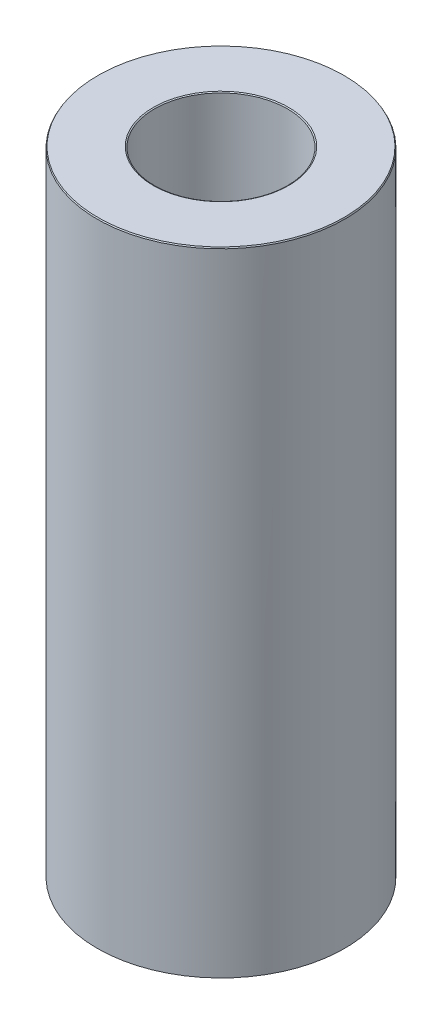
ISO-10303-21;
HEADER;
FILE_DESCRIPTION(('STEP AP214'),'2;1');
FILE_NAME('part.step','',(''),(''),'','','');
FILE_SCHEMA(('AUTOMOTIVE_DESIGN { 1 0 10303 214 1 1 1 1 }'));
ENDSEC;
DATA;
#1=APPLICATION_CONTEXT('core data for automotive mechanical design processes');
#2=APPLICATION_PROTOCOL_DEFINITION('international standard','automotive_design',2000,#1);
#3=PRODUCT_CONTEXT('',#1,'mechanical');
#4=PRODUCT('Part','Part','',(#3));
#5=PRODUCT_RELATED_PRODUCT_CATEGORY('part','',(#4));
#6=PRODUCT_DEFINITION_FORMATION('','',#4);
#7=PRODUCT_DEFINITION_CONTEXT('part definition',#1,'design');
#8=PRODUCT_DEFINITION('design','',#6,#7);
#9=PRODUCT_DEFINITION_SHAPE('','',#8);
#10=(LENGTH_UNIT() NAMED_UNIT(*) SI_UNIT(.MILLI.,.METRE.));
#11=(NAMED_UNIT(*) PLANE_ANGLE_UNIT() SI_UNIT($,.RADIAN.));
#12=(NAMED_UNIT(*) SI_UNIT($,.STERADIAN.) SOLID_ANGLE_UNIT());
#13=UNCERTAINTY_MEASURE_WITH_UNIT(LENGTH_MEASURE(1.E-05),#10,'distance_accuracy_value','');
#14=(GEOMETRIC_REPRESENTATION_CONTEXT(3) GLOBAL_UNCERTAINTY_ASSIGNED_CONTEXT((#13)) GLOBAL_UNIT_ASSIGNED_CONTEXT((#10,
#11,#12)) REPRESENTATION_CONTEXT('',''));
#15=CARTESIAN_POINT('',(0.,0.,0.));
#16=DIRECTION('',(0.,0.,1.));
#17=DIRECTION('',(1.,0.,0.));
#18=AXIS2_PLACEMENT_3D('',#15,#16,#17);
#19=CARTESIAN_POINT('',(0.,255.949453428713,0.));
#20=DIRECTION('',(0.,-1.,0.));
#21=DIRECTION('',(0.,0.,-1.));
#22=AXIS2_PLACEMENT_3D('',#19,#20,#21);
#23=CYLINDRICAL_SURFACE('',#22,50.);
#24=CARTESIAN_POINT('',(0.,0.272738288662366,0.));
#25=DIRECTION('',(0.,1.,0.));
#26=DIRECTION('',(0.,0.,1.));
#27=AXIS2_PLACEMENT_3D('',#24,#25,#26);
#28=CIRCLE('',#27,50.);
#29=CARTESIAN_POINT('',(0.,0.272738288662366,50.));
#30=VERTEX_POINT('',#29);
#31=EDGE_CURVE('E10',#30,#30,#28,.T.);
#32=ORIENTED_EDGE('',*,*,#31,.T.);
#33=EDGE_LOOP('',(#32));
#34=FACE_BOUND('',#33,.T.);
#35=CARTESIAN_POINT('',(0.,255.47705685558,0.));
#36=DIRECTION('',(0.,1.,0.));
#37=DIRECTION('',(0.,0.,1.));
#38=AXIS2_PLACEMENT_3D('',#35,#36,#37);
#39=CIRCLE('',#38,50.);
#40=CARTESIAN_POINT('',(0.,255.47705685558,-50.));
#41=VERTEX_POINT('',#40);
#42=EDGE_CURVE('E50',#41,#41,#39,.F.);
#43=ORIENTED_EDGE('',*,*,#42,.T.);
#44=EDGE_LOOP('',(#43));
#45=FACE_BOUND('',#44,.T.);
#46=ADVANCED_FACE('F39',(#34,#45),#23,.T.);
#47=CARTESIAN_POINT('',(0.,255.949453428713,0.));
#48=DIRECTION('',(0.,1.,0.));
#49=DIRECTION('',(0.,0.,1.));
#50=AXIS2_PLACEMENT_3D('',#47,#48,#49);
#51=PLANE('',#50);
#52=CARTESIAN_POINT('',(0.,255.949453428713,0.));
#53=DIRECTION('',(0.,1.,0.));
#54=DIRECTION('',(0.,0.,1.));
#55=AXIS2_PLACEMENT_3D('',#52,#53,#54);
#56=CIRCLE('',#55,27.3661072955156);
#57=CARTESIAN_POINT('',(0.,255.949453428713,27.3661072955156));
#58=VERTEX_POINT('',#57);
#59=EDGE_CURVE('E58',#58,#58,#56,.F.);
#60=ORIENTED_EDGE('',*,*,#59,.T.);
#61=EDGE_LOOP('',(#60));
#62=FACE_BOUND('',#61,.T.);
#63=CARTESIAN_POINT('',(0.,255.949453428713,0.));
#64=DIRECTION('',(0.,1.,0.));
#65=DIRECTION('',(0.,0.,1.));
#66=AXIS2_PLACEMENT_3D('',#63,#64,#65);
#67=CIRCLE('',#66,49.7272617113375);
#68=CARTESIAN_POINT('',(0.,255.949453428713,-49.7272617113376));
#69=VERTEX_POINT('',#68);
#70=EDGE_CURVE('E61',#69,#69,#67,.T.);
#71=ORIENTED_EDGE('',*,*,#70,.T.);
#72=EDGE_LOOP('',(#71));
#73=FACE_BOUND('',#72,.T.);
#74=ADVANCED_FACE('F88',(#62,#73),#51,.T.);
#75=CARTESIAN_POINT('',(0.,0.,0.));
#76=DIRECTION('',(0.,1.,0.));
#77=DIRECTION('',(0.,0.,1.));
#78=AXIS2_PLACEMENT_3D('',#75,#76,#77);
#79=PLANE('',#78);
#80=CARTESIAN_POINT('',(0.,0.,0.));
#81=DIRECTION('',(0.,1.,0.));
#82=DIRECTION('',(0.,0.,1.));
#83=AXIS2_PLACEMENT_3D('',#80,#81,#82);
#84=CIRCLE('',#83,27.1664490110454);
#85=CARTESIAN_POINT('',(0.,0.,-27.1664490110454));
#86=VERTEX_POINT('',#85);
#87=EDGE_CURVE('E51',#86,#86,#84,.T.);
#88=ORIENTED_EDGE('',*,*,#87,.T.);
#89=EDGE_LOOP('',(#88));
#90=FACE_BOUND('',#89,.T.);
#91=CARTESIAN_POINT('',(0.,0.,0.));
#92=DIRECTION('',(0.,1.,0.));
#93=DIRECTION('',(0.,0.,1.));
#94=AXIS2_PLACEMENT_3D('',#91,#92,#93);
#95=CIRCLE('',#94,49.5276034268674);
#96=CARTESIAN_POINT('',(0.,0.,49.5276034268674));
#97=VERTEX_POINT('',#96);
#98=EDGE_CURVE('E54',#97,#97,#95,.F.);
#99=ORIENTED_EDGE('',*,*,#98,.T.);
#100=EDGE_LOOP('',(#99));
#101=FACE_BOUND('',#100,.T.);
#102=ADVANCED_FACE('F83',(#90,#101),#79,.F.);
#103=CARTESIAN_POINT('',(0.,255.949453428713,0.));
#104=DIRECTION('',(0.,-1.,0.));
#105=DIRECTION('',(0.,0.,-1.));
#106=AXIS2_PLACEMENT_3D('',#103,#104,#105);
#107=CYLINDRICAL_SURFACE('',#106,26.893710722383);
#108=CARTESIAN_POINT('',(0.,255.67671514005,0.));
#109=DIRECTION('',(0.,1.,0.));
#110=DIRECTION('',(0.,0.,1.));
#111=AXIS2_PLACEMENT_3D('',#108,#109,#110);
#112=CIRCLE('',#111,26.893710722383);
#113=CARTESIAN_POINT('',(0.,255.67671514005,26.893710722383));
#114=VERTEX_POINT('',#113);
#115=EDGE_CURVE('E67',#114,#114,#112,.T.);
#116=ORIENTED_EDGE('',*,*,#115,.T.);
#117=EDGE_LOOP('',(#116));
#118=FACE_BOUND('',#117,.T.);
#119=CARTESIAN_POINT('',(0.,0.472396573132694,0.));
#120=DIRECTION('',(0.,1.,0.));
#121=DIRECTION('',(0.,0.,1.));
#122=AXIS2_PLACEMENT_3D('',#119,#120,#121);
#123=CIRCLE('',#122,26.893710722383);
#124=CARTESIAN_POINT('',(0.,0.472396573132694,-26.893710722383));
#125=VERTEX_POINT('',#124);
#126=EDGE_CURVE('E69',#125,#125,#123,.F.);
#127=ORIENTED_EDGE('',*,*,#126,.T.);
#128=EDGE_LOOP('',(#127));
#129=FACE_BOUND('',#128,.T.);
#130=ADVANCED_FACE('F71',(#118,#129),#107,.F.);
#131=CARTESIAN_POINT('',(0.,255.67671514005,0.));
#132=DIRECTION('',(0.,1.,0.));
#133=DIRECTION('',(0.,0.,1.));
#134=AXIS2_PLACEMENT_3D('',#131,#132,#133);
#135=CONICAL_SURFACE('',#134,26.893710722383,1.04719755119662);
#136=ORIENTED_EDGE('',*,*,#59,.F.);
#137=EDGE_LOOP('',(#136));
#138=FACE_BOUND('',#137,.T.);
#139=ORIENTED_EDGE('',*,*,#115,.F.);
#140=EDGE_LOOP('',(#139));
#141=FACE_BOUND('',#140,.T.);
#142=ADVANCED_FACE('F77',(#138,#141),#135,.F.);
#143=CARTESIAN_POINT('',(0.,0.,0.));
#144=DIRECTION('',(0.,-1.,0.));
#145=DIRECTION('',(0.,0.,-1.));
#146=AXIS2_PLACEMENT_3D('',#143,#144,#145);
#147=CONICAL_SURFACE('',#146,27.1664490110454,0.523598775598251);
#148=CARTESIAN_POINT('',(0.,0.472396573132694,-26.893710722383));
#149=CARTESIAN_POINT('',(0.,0.467475775495895,-26.8965517462232));
#150=CARTESIAN_POINT('',(0.,0.462554977859096,-26.8993927700635));
#151=CARTESIAN_POINT('',(0.,0.452713382585498,-26.9050748177439));
#152=CARTESIAN_POINT('',(0.,0.447792584948699,-26.9079158415842));
#153=CARTESIAN_POINT('',(0.,0.437950989675102,-26.9135978892646));
#154=CARTESIAN_POINT('',(0.,0.433030192038303,-26.9164389131049));
#155=CARTESIAN_POINT('',(0.,0.423188596764705,-26.9221209607853));
#156=CARTESIAN_POINT('',(0.,0.418267799127906,-26.9249619846256));
#157=CARTESIAN_POINT('',(0.,0.408426203854308,-26.930644032306));
#158=CARTESIAN_POINT('',(0.,0.403505406217509,-26.9334850561463));
#159=CARTESIAN_POINT('',(0.,0.393663810943912,-26.9391671038267));
#160=CARTESIAN_POINT('',(0.,0.388743013307113,-26.942008127667));
#161=CARTESIAN_POINT('',(0.,0.378901418033515,-26.9476901753474));
#162=CARTESIAN_POINT('',(0.,0.373980620396716,-26.9505311991877));
#163=CARTESIAN_POINT('',(0.,0.364139025123118,-26.9562132468681));
#164=CARTESIAN_POINT('',(0.,0.359218227486319,-26.9590542707084));
#165=CARTESIAN_POINT('',(0.,0.349376632212722,-26.9647363183888));
#166=CARTESIAN_POINT('',(0.,0.344455834575923,-26.9675773422291));
#167=CARTESIAN_POINT('',(0.,0.334614239302325,-26.9732593899095));
#168=CARTESIAN_POINT('',(0.,0.329693441665526,-26.9761004137498));
#169=CARTESIAN_POINT('',(0.,0.319851846391928,-26.9817824614302));
#170=CARTESIAN_POINT('',(0.,0.314931048755129,-26.9846234852705));
#171=CARTESIAN_POINT('',(0.,0.305089453481531,-26.9903055329509));
#172=CARTESIAN_POINT('',(0.,0.300168655844733,-26.9931465567912));
#173=CARTESIAN_POINT('',(0.,0.290327060571135,-26.9988286044716));
#174=CARTESIAN_POINT('',(0.,0.285406262934336,-27.0016696283119));
#175=CARTESIAN_POINT('',(0.,0.275564667660738,-27.0073516759923));
#176=CARTESIAN_POINT('',(0.,0.270643870023939,-27.0101926998326));
#177=CARTESIAN_POINT('',(0.,0.260802274750342,-27.015874747513));
#178=CARTESIAN_POINT('',(0.,0.255881477113543,-27.0187157713533));
#179=CARTESIAN_POINT('',(0.,0.246039881839945,-27.0243978190337));
#180=CARTESIAN_POINT('',(0.,0.241119084203146,-27.027238842874));
#181=CARTESIAN_POINT('',(0.,0.231277488929548,-27.0329208905544));
#182=CARTESIAN_POINT('',(0.,0.226356691292749,-27.0357619143947));
#183=CARTESIAN_POINT('',(0.,0.216515096019151,-27.0414439620751));
#184=CARTESIAN_POINT('',(0.,0.211594298382352,-27.0442849859154));
#185=CARTESIAN_POINT('',(0.,0.201752703108755,-27.0499670335958));
#186=CARTESIAN_POINT('',(0.,0.196831905471956,-27.0528080574361));
#187=CARTESIAN_POINT('',(0.,0.186990310198358,-27.0584901051165));
#188=CARTESIAN_POINT('',(0.,0.182069512561559,-27.0613311289568));
#189=CARTESIAN_POINT('',(0.,0.172227917287961,-27.0670131766372));
#190=CARTESIAN_POINT('',(0.,0.167307119651162,-27.0698542004775));
#191=CARTESIAN_POINT('',(0.,0.157465524377565,-27.0755362481579));
#192=CARTESIAN_POINT('',(0.,0.152544726740766,-27.0783772719982));
#193=CARTESIAN_POINT('',(0.,0.142703131467168,-27.0840593196786));
#194=CARTESIAN_POINT('',(0.,0.137782333830369,-27.0869003435189));
#195=CARTESIAN_POINT('',(0.,0.127940738556771,-27.0925823911993));
#196=CARTESIAN_POINT('',(0.,0.123019940919972,-27.0954234150396));
#197=CARTESIAN_POINT('',(0.,0.113178345646374,-27.10110546272));
#198=CARTESIAN_POINT('',(0.,0.108257548009576,-27.1039464865603));
#199=CARTESIAN_POINT('',(0.,0.0984159527359782,-27.1096285342407));
#200=CARTESIAN_POINT('',(0.,0.0934951550991791,-27.112469558081));
#201=CARTESIAN_POINT('',(0.,0.0836535598255811,-27.1181516057614));
#202=CARTESIAN_POINT('',(0.,0.0787327621887823,-27.1209926296017));
#203=CARTESIAN_POINT('',(0.,0.0688911669151846,-27.1266746772821));
#204=CARTESIAN_POINT('',(0.,0.0639703692783857,-27.1295157011224));
#205=CARTESIAN_POINT('',(0.,0.0541287740047878,-27.1351977488028));
#206=CARTESIAN_POINT('',(0.,0.0492079763679886,-27.1380387726431));
#207=CARTESIAN_POINT('',(0.,0.039366381094391,-27.1437208203235));
#208=CARTESIAN_POINT('',(0.,0.0344455834575924,-27.1465618441638));
#209=CARTESIAN_POINT('',(0.,0.0246039881839948,-27.1522438918442));
#210=CARTESIAN_POINT('',(0.,0.0196831905471958,-27.1550849156845));
#211=CARTESIAN_POINT('',(0.,0.00984159527359762,-27.1607669633649));
#212=CARTESIAN_POINT('',(0.,0.00492079763679855,-27.1636079872052));
#213=CARTESIAN_POINT('',(0.,0.,-27.1664490110454));
#214=B_SPLINE_CURVE_WITH_KNOTS('',3,(#148,#149,#150,#151,#152,#153,#154,#155,#156,#157,#158,
#159,#160,#161,#162,#163,#164,#165,#166,#167,#168,#169,#170,#171,#172,#173,#174,#175,#176,#177,
#178,#179,#180,#181,#182,#183,#184,#185,#186,#187,#188,#189,#190,#191,#192,#193,#194,#195,#196,
#197,#198,#199,#200,#201,#202,#203,#204,#205,#206,#207,#208,#209,#210,#211,#212,#213),
.UNSPECIFIED.,.F.,.F.,(4,2,2,2,2,2,2,2,2,2,2,2,2,2,2,2,2,2,2,2,2,2,2,2,2,2,2,2,2,2,2,2,4),(0.,
0.0170461430414003,0.0340922860828006,0.0511384291242026,0.0681845721656029,0.0852307152070032,
0.102276858248404,0.119323001289804,0.136369144331206,0.153415287372606,0.170461430414006,
0.187507573455407,0.204553716496807,0.221599859538207,0.238646002579609,0.25569214562101,
0.27273828866241,0.28978443170381,0.306830574745211,0.323876717786613,0.340922860828013,
0.357969003869413,0.375015146910814,0.392061289952214,0.409107432993614,0.426153576035016,
0.443199719076416,0.460245862117817,0.477292005159217,0.494338148200617,0.511384291242019,
0.52843043428342,0.54547657732482),.UNSPECIFIED.);
#215=EDGE_CURVE('BSEAM73',#125,#86,#214,.T.);
#216=ORIENTED_EDGE('',*,*,#126,.F.);
#217=ORIENTED_EDGE('',*,*,#87,.F.);
#218=ORIENTED_EDGE('',*,*,#215,.T.);
#219=ORIENTED_EDGE('',*,*,#215,.F.);
#220=EDGE_LOOP('',(#216,#218,#217,#219));
#221=FACE_BOUND('',#220,.T.);
#222=ADVANCED_FACE('F73',(#221),#147,.F.);
#223=CARTESIAN_POINT('',(0.,0.272738288662366,0.));
#224=DIRECTION('',(0.,1.,0.));
#225=DIRECTION('',(0.,0.,1.));
#226=AXIS2_PLACEMENT_3D('',#223,#224,#225);
#227=CONICAL_SURFACE('',#226,50.,1.04719755119662);
#228=ORIENTED_EDGE('',*,*,#98,.F.);
#229=EDGE_LOOP('',(#228));
#230=FACE_BOUND('',#229,.T.);
#231=ORIENTED_EDGE('',*,*,#31,.F.);
#232=EDGE_LOOP('',(#231));
#233=FACE_BOUND('',#232,.T.);
#234=ADVANCED_FACE('F76',(#230,#233),#227,.T.);
#235=CARTESIAN_POINT('',(0.,255.949453428713,0.));
#236=DIRECTION('',(0.,-1.,0.));
#237=DIRECTION('',(0.,0.,-1.));
#238=AXIS2_PLACEMENT_3D('',#235,#236,#237);
#239=CONICAL_SURFACE('',#238,49.7272617113375,0.523598775598321);
#240=CARTESIAN_POINT('',(0.,255.47705685558,-50.));
#241=CARTESIAN_POINT('',(0.,255.481977653217,-49.9971589761598));
#242=CARTESIAN_POINT('',(0.,255.486898450853,-49.9943179523196));
#243=CARTESIAN_POINT('',(0.,255.496740046127,-49.9886359046391));
#244=CARTESIAN_POINT('',(0.,255.501660843764,-49.9857948807988));
#245=CARTESIAN_POINT('',(0.,255.511502439037,-49.9801128331184));
#246=CARTESIAN_POINT('',(0.,255.516423236674,-49.9772718092782));
#247=CARTESIAN_POINT('',(0.,255.526264831948,-49.9715897615977));
#248=CARTESIAN_POINT('',(0.,255.531185629585,-49.9687487377574));
#249=CARTESIAN_POINT('',(0.,255.541027224858,-49.963066690077));
#250=CARTESIAN_POINT('',(0.,255.545948022495,-49.9602256662368));
#251=CARTESIAN_POINT('',(0.,255.555789617769,-49.9545436185563));
#252=CARTESIAN_POINT('',(0.,255.560710415405,-49.951702594716));
#253=CARTESIAN_POINT('',(0.,255.570552010679,-49.9460205470356));
#254=CARTESIAN_POINT('',(0.,255.575472808316,-49.9431795231953));
#255=CARTESIAN_POINT('',(0.,255.58531440359,-49.9374974755149));
#256=CARTESIAN_POINT('',(0.,255.590235201226,-49.9346564516746));
#257=CARTESIAN_POINT('',(0.,255.6000767965,-49.9289744039942));
#258=CARTESIAN_POINT('',(0.,255.604997594137,-49.9261333801539));
#259=CARTESIAN_POINT('',(0.,255.61483918941,-49.9204513324735));
#260=CARTESIAN_POINT('',(0.,255.619759987047,-49.9176103086332));
#261=CARTESIAN_POINT('',(0.,255.629601582321,-49.9119282609528));
#262=CARTESIAN_POINT('',(0.,255.634522379957,-49.9090872371125));
#263=CARTESIAN_POINT('',(0.,255.644363975231,-49.9034051894321));
#264=CARTESIAN_POINT('',(0.,255.649284772868,-49.9005641655918));
#265=CARTESIAN_POINT('',(0.,255.659126368141,-49.8948821179114));
#266=CARTESIAN_POINT('',(0.,255.664047165778,-49.8920410940711));
#267=CARTESIAN_POINT('',(0.,255.673888761052,-49.8863590463907));
#268=CARTESIAN_POINT('',(0.,255.678809558689,-49.8835180225504));
#269=CARTESIAN_POINT('',(0.,255.688651153962,-49.87783597487));
#270=CARTESIAN_POINT('',(0.,255.693571951599,-49.8749949510297));
#271=CARTESIAN_POINT('',(0.,255.703413546873,-49.8693129033493));
#272=CARTESIAN_POINT('',(0.,255.708334344509,-49.866471879509));
#273=CARTESIAN_POINT('',(0.,255.718175939783,-49.8607898318285));
#274=CARTESIAN_POINT('',(0.,255.72309673742,-49.8579488079883));
#275=CARTESIAN_POINT('',(0.,255.732938332693,-49.8522667603078));
#276=CARTESIAN_POINT('',(0.,255.73785913033,-49.8494257364676));
#277=CARTESIAN_POINT('',(0.,255.747700725604,-49.8437436887871));
#278=CARTESIAN_POINT('',(0.,255.752621523241,-49.8409026649469));
#279=CARTESIAN_POINT('',(0.,255.762463118514,-49.8352206172664));
#280=CARTESIAN_POINT('',(0.,255.767383916151,-49.8323795934262));
#281=CARTESIAN_POINT('',(0.,255.777225511425,-49.8266975457458));
#282=CARTESIAN_POINT('',(0.,255.782146309061,-49.8238565219055));
#283=CARTESIAN_POINT('',(0.,255.791987904335,-49.818174474225));
#284=CARTESIAN_POINT('',(0.,255.796908701972,-49.8153334503848));
#285=CARTESIAN_POINT('',(0.,255.806750297245,-49.8096514027043));
#286=CARTESIAN_POINT('',(0.,255.811671094882,-49.8068103788641));
#287=CARTESIAN_POINT('',(0.,255.821512690156,-49.8011283311836));
#288=CARTESIAN_POINT('',(0.,255.826433487793,-49.7982873073434));
#289=CARTESIAN_POINT('',(0.,255.836275083066,-49.7926052596629));
#290=CARTESIAN_POINT('',(0.,255.841195880703,-49.7897642358227));
#291=CARTESIAN_POINT('',(0.,255.851037475977,-49.7840821881422));
#292=CARTESIAN_POINT('',(0.,255.855958273613,-49.781241164302));
#293=CARTESIAN_POINT('',(0.,255.865799868887,-49.7755591166215));
#294=CARTESIAN_POINT('',(0.,255.870720666524,-49.7727180927813));
#295=CARTESIAN_POINT('',(0.,255.880562261797,-49.7670360451008));
#296=CARTESIAN_POINT('',(0.,255.885483059434,-49.7641950212606));
#297=CARTESIAN_POINT('',(0.,255.895324654708,-49.7585129735801));
#298=CARTESIAN_POINT('',(0.,255.900245452345,-49.7556719497399));
#299=CARTESIAN_POINT('',(0.,255.910087047618,-49.7499899020594));
#300=CARTESIAN_POINT('',(0.,255.915007845255,-49.7471488782192));
#301=CARTESIAN_POINT('',(0.,255.924849440529,-49.7414668305387));
#302=CARTESIAN_POINT('',(0.,255.929770238165,-49.7386258066985));
#303=CARTESIAN_POINT('',(0.,255.939611833439,-49.732943759018));
#304=CARTESIAN_POINT('',(0.,255.944532631076,-49.7301027351778));
#305=CARTESIAN_POINT('',(0.,255.949453428713,-49.7272617113376));
#306=B_SPLINE_CURVE_WITH_KNOTS('',3,(#240,#241,#242,#243,#244,#245,#246,#247,#248,#249,#250,
#251,#252,#253,#254,#255,#256,#257,#258,#259,#260,#261,#262,#263,#264,#265,#266,#267,#268,#269,
#270,#271,#272,#273,#274,#275,#276,#277,#278,#279,#280,#281,#282,#283,#284,#285,#286,#287,#288,
#289,#290,#291,#292,#293,#294,#295,#296,#297,#298,#299,#300,#301,#302,#303,#304,#305),
.UNSPECIFIED.,.F.,.F.,(4,2,2,2,2,2,2,2,2,2,2,2,2,2,2,2,2,2,2,2,2,2,2,2,2,2,2,2,2,2,2,2,4),(0.,
0.017046143041381,0.034092286082762,0.0511384291241911,0.0681845721655686,0.0852307152069977,
0.102276858248379,0.119323001289808,0.136369144331189,0.153415287372618,0.170461430413999,
0.187507573455428,0.204553716496809,0.221599859538238,0.238646002579619,0.255692145621048,
0.272738288662429,0.28978443170381,0.306830574745239,0.32387671778662,0.340922860828046,
0.357969003869427,0.375015146910856,0.392061289952237,0.409107432993666,0.426153576035047,
0.443199719076476,0.460245862117857,0.477292005159286,0.494338148200667,0.511384291242096,
0.528430434283477,0.545476577324906),.UNSPECIFIED.);
#307=EDGE_CURVE('BSEAM45',#41,#69,#306,.T.);
#308=ORIENTED_EDGE('',*,*,#42,.F.);
#309=ORIENTED_EDGE('',*,*,#70,.F.);
#310=ORIENTED_EDGE('',*,*,#307,.T.);
#311=ORIENTED_EDGE('',*,*,#307,.F.);
#312=EDGE_LOOP('',(#308,#310,#309,#311));
#313=FACE_BOUND('',#312,.T.);
#314=ADVANCED_FACE('F45',(#313),#239,.T.);
#315=CLOSED_SHELL('',(#46,#74,#102,#130,#142,#222,#234,#314));
#316=MANIFOLD_SOLID_BREP('B2',#315);
#317=ADVANCED_BREP_SHAPE_REPRESENTATION('',(#18,#316),#14);
#318=SHAPE_DEFINITION_REPRESENTATION(#9,#317);
ENDSEC;
END-ISO-10303-21;
